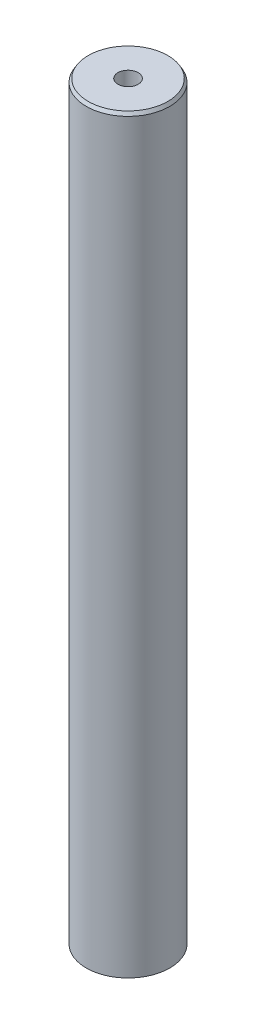
ISO-10303-21;
HEADER;
FILE_DESCRIPTION(('STEP AP214'),'2;1');
FILE_NAME('part.step','',(''),(''),'','','');
FILE_SCHEMA(('AUTOMOTIVE_DESIGN { 1 0 10303 214 1 1 1 1 }'));
ENDSEC;
DATA;
#1=APPLICATION_CONTEXT('core data for automotive mechanical design processes');
#2=APPLICATION_PROTOCOL_DEFINITION('international standard','automotive_design',2000,#1);
#3=PRODUCT_CONTEXT('',#1,'mechanical');
#4=PRODUCT('Part','Part','',(#3));
#5=PRODUCT_RELATED_PRODUCT_CATEGORY('part','',(#4));
#6=PRODUCT_DEFINITION_FORMATION('','',#4);
#7=PRODUCT_DEFINITION_CONTEXT('part definition',#1,'design');
#8=PRODUCT_DEFINITION('design','',#6,#7);
#9=PRODUCT_DEFINITION_SHAPE('','',#8);
#10=(LENGTH_UNIT() NAMED_UNIT(*) SI_UNIT(.MILLI.,.METRE.));
#11=(NAMED_UNIT(*) PLANE_ANGLE_UNIT() SI_UNIT($,.RADIAN.));
#12=(NAMED_UNIT(*) SI_UNIT($,.STERADIAN.) SOLID_ANGLE_UNIT());
#13=UNCERTAINTY_MEASURE_WITH_UNIT(LENGTH_MEASURE(1.E-05),#10,'distance_accuracy_value','');
#14=(GEOMETRIC_REPRESENTATION_CONTEXT(3) GLOBAL_UNCERTAINTY_ASSIGNED_CONTEXT((#13)) GLOBAL_UNIT_ASSIGNED_CONTEXT((#10,
#11,#12)) REPRESENTATION_CONTEXT('',''));
#15=CARTESIAN_POINT('',(0.,0.,0.));
#16=DIRECTION('',(0.,0.,1.));
#17=DIRECTION('',(1.,0.,0.));
#18=AXIS2_PLACEMENT_3D('',#15,#16,#17);
#19=CARTESIAN_POINT('',(0.,90.0144444900333,0.));
#20=DIRECTION('',(0.,-1.,0.));
#21=DIRECTION('',(0.,0.,-1.));
#22=AXIS2_PLACEMENT_3D('',#19,#20,#21);
#23=CYLINDRICAL_SURFACE('',#22,5.);
#24=CARTESIAN_POINT('',(0.,89.6137177139328,0.));
#25=DIRECTION('',(0.,1.,0.));
#26=DIRECTION('',(0.,0.,1.));
#27=AXIS2_PLACEMENT_3D('',#24,#25,#26);
#28=CIRCLE('',#27,5.);
#29=CARTESIAN_POINT('',(0.,89.6137177139328,-5.));
#30=VERTEX_POINT('',#29);
#31=EDGE_CURVE('E50',#30,#30,#28,.F.);
#32=ORIENTED_EDGE('',*,*,#31,.T.);
#33=EDGE_LOOP('',(#32));
#34=FACE_BOUND('',#33,.T.);
#35=CARTESIAN_POINT('',(0.,0.231359712053125,0.));
#36=DIRECTION('',(0.,1.,0.));
#37=DIRECTION('',(0.,0.,1.));
#38=AXIS2_PLACEMENT_3D('',#35,#36,#37);
#39=CIRCLE('',#38,5.);
#40=CARTESIAN_POINT('',(0.,0.231359712053125,5.));
#41=VERTEX_POINT('',#40);
#42=EDGE_CURVE('E51',#41,#41,#39,.T.);
#43=ORIENTED_EDGE('',*,*,#42,.T.);
#44=EDGE_LOOP('',(#43));
#45=FACE_BOUND('',#44,.T.);
#46=ADVANCED_FACE('F39',(#34,#45),#23,.T.);
#47=CARTESIAN_POINT('',(0.,90.0144444900333,0.));
#48=DIRECTION('',(0.,1.,0.));
#49=DIRECTION('',(0.,0.,1.));
#50=AXIS2_PLACEMENT_3D('',#47,#48,#49);
#51=PLANE('',#50);
#52=CARTESIAN_POINT('',(0.,90.0144444900333,0.));
#53=DIRECTION('',(0.,1.,0.));
#54=DIRECTION('',(0.,0.,1.));
#55=AXIS2_PLACEMENT_3D('',#52,#53,#54);
#56=CIRCLE('',#55,4.76864028794688);
#57=CARTESIAN_POINT('',(0.,90.0144444900333,-4.76864028794688));
#58=VERTEX_POINT('',#57);
#59=EDGE_CURVE('E54',#58,#58,#56,.T.);
#60=ORIENTED_EDGE('',*,*,#59,.T.);
#61=EDGE_LOOP('',(#60));
#62=FACE_BOUND('',#61,.T.);
#63=CARTESIAN_POINT('',(0.,90.0144444900333,0.));
#64=DIRECTION('',(0.,1.,0.));
#65=DIRECTION('',(0.,0.,1.));
#66=AXIS2_PLACEMENT_3D('',#63,#64,#65);
#67=CIRCLE('',#66,1.21272724082302);
#68=CARTESIAN_POINT('',(0.,90.0144444900333,1.21272724082302));
#69=VERTEX_POINT('',#68);
#70=EDGE_CURVE('E58',#69,#69,#67,.T.);
#71=ORIENTED_EDGE('',*,*,#70,.F.);
#72=EDGE_LOOP('',(#71));
#73=FACE_BOUND('',#72,.T.);
#74=ADVANCED_FACE('F69',(#62,#73),#51,.T.);
#75=CARTESIAN_POINT('',(0.,0.,0.));
#76=DIRECTION('',(0.,1.,0.));
#77=DIRECTION('',(0.,0.,1.));
#78=AXIS2_PLACEMENT_3D('',#75,#76,#77);
#79=PLANE('',#78);
#80=CARTESIAN_POINT('',(0.,0.,0.));
#81=DIRECTION('',(0.,1.,0.));
#82=DIRECTION('',(0.,0.,1.));
#83=AXIS2_PLACEMENT_3D('',#80,#81,#82);
#84=CIRCLE('',#83,4.59927322389948);
#85=CARTESIAN_POINT('',(0.,0.,4.59927322389948));
#86=VERTEX_POINT('',#85);
#87=EDGE_CURVE('E10',#86,#86,#84,.F.);
#88=ORIENTED_EDGE('',*,*,#87,.T.);
#89=EDGE_LOOP('',(#88));
#90=FACE_BOUND('',#89,.T.);
#91=CARTESIAN_POINT('',(0.,0.,0.));
#92=DIRECTION('',(0.,1.,0.));
#93=DIRECTION('',(0.,0.,1.));
#94=AXIS2_PLACEMENT_3D('',#91,#92,#93);
#95=CIRCLE('',#94,1.21272724082302);
#96=CARTESIAN_POINT('',(0.,0.,1.21272724082302));
#97=VERTEX_POINT('',#96);
#98=EDGE_CURVE('E63',#97,#97,#95,.T.);
#99=ORIENTED_EDGE('',*,*,#98,.T.);
#100=EDGE_LOOP('',(#99));
#101=FACE_BOUND('',#100,.T.);
#102=ADVANCED_FACE('F75',(#90,#101),#79,.F.);
#103=CARTESIAN_POINT('',(0.,90.0144444900333,0.));
#104=DIRECTION('',(0.,-1.,0.));
#105=DIRECTION('',(0.,0.,-1.));
#106=AXIS2_PLACEMENT_3D('',#103,#104,#105);
#107=CYLINDRICAL_SURFACE('',#106,1.21272724082302);
#108=ORIENTED_EDGE('',*,*,#70,.T.);
#109=EDGE_LOOP('',(#108));
#110=FACE_BOUND('',#109,.T.);
#111=ORIENTED_EDGE('',*,*,#98,.F.);
#112=EDGE_LOOP('',(#111));
#113=FACE_BOUND('',#112,.T.);
#114=ADVANCED_FACE('F70',(#110,#113),#107,.F.);
#115=CARTESIAN_POINT('',(0.,90.0144444900333,0.));
#116=DIRECTION('',(0.,-1.,0.));
#117=DIRECTION('',(0.,0.,-1.));
#118=AXIS2_PLACEMENT_3D('',#115,#116,#117);
#119=CONICAL_SURFACE('',#118,4.76864028794688,0.523598775598288);
#120=CARTESIAN_POINT('',(0.,89.6137177139328,-5.));
#121=CARTESIAN_POINT('',(0.,89.6178919511839,-4.99759000299945));
#122=CARTESIAN_POINT('',(0.,89.6220661884349,-4.9951800059989));
#123=CARTESIAN_POINT('',(0.,89.630414662937,-4.99036001199779));
#124=CARTESIAN_POINT('',(0.,89.634588900188,-4.98795001499724));
#125=CARTESIAN_POINT('',(0.,89.6429373746901,-4.98313002099613));
#126=CARTESIAN_POINT('',(0.,89.6471116119412,-4.98072002399558));
#127=CARTESIAN_POINT('',(0.,89.6554600864433,-4.97590002999447));
#128=CARTESIAN_POINT('',(0.,89.6596343236943,-4.97349003299392));
#129=CARTESIAN_POINT('',(0.,89.6679827981964,-4.96867003899281));
#130=CARTESIAN_POINT('',(0.,89.6721570354475,-4.96626004199226));
#131=CARTESIAN_POINT('',(0.,89.6805055099496,-4.96144004799115));
#132=CARTESIAN_POINT('',(0.,89.6846797472006,-4.9590300509906));
#133=CARTESIAN_POINT('',(0.,89.6930282217027,-4.95421005698949));
#134=CARTESIAN_POINT('',(0.,89.6972024589538,-4.95180005998894));
#135=CARTESIAN_POINT('',(0.,89.7055509334559,-4.94698006598783));
#136=CARTESIAN_POINT('',(0.,89.7097251707069,-4.94457006898728));
#137=CARTESIAN_POINT('',(0.,89.718073645209,-4.93975007498617));
#138=CARTESIAN_POINT('',(0.,89.72224788246,-4.93734007798562));
#139=CARTESIAN_POINT('',(0.,89.7305963569621,-4.93252008398451));
#140=CARTESIAN_POINT('',(0.,89.7347705942132,-4.93011008698396));
#141=CARTESIAN_POINT('',(0.,89.7431190687153,-4.92529009298285));
#142=CARTESIAN_POINT('',(0.,89.7472933059663,-4.9228800959823));
#143=CARTESIAN_POINT('',(0.,89.7556417804684,-4.91806010198119));
#144=CARTESIAN_POINT('',(0.,89.7598160177195,-4.91565010498064));
#145=CARTESIAN_POINT('',(0.,89.7681644922216,-4.91083011097953));
#146=CARTESIAN_POINT('',(0.,89.7723387294726,-4.90842011397898));
#147=CARTESIAN_POINT('',(0.,89.7806872039747,-4.90360011997787));
#148=CARTESIAN_POINT('',(0.,89.7848614412257,-4.90119012297732));
#149=CARTESIAN_POINT('',(0.,89.7932099157278,-4.89637012897621));
#150=CARTESIAN_POINT('',(0.,89.7973841529789,-4.89396013197566));
#151=CARTESIAN_POINT('',(0.,89.805732627481,-4.88914013797455));
#152=CARTESIAN_POINT('',(0.,89.809906864732,-4.886730140974));
#153=CARTESIAN_POINT('',(0.,89.8182553392341,-4.88191014697289));
#154=CARTESIAN_POINT('',(0.,89.8224295764852,-4.87950014997234));
#155=CARTESIAN_POINT('',(0.,89.8307780509873,-4.87468015597123));
#156=CARTESIAN_POINT('',(0.,89.8349522882383,-4.87227015897068));
#157=CARTESIAN_POINT('',(0.,89.8433007627404,-4.86745016496957));
#158=CARTESIAN_POINT('',(0.,89.8474749999915,-4.86504016796902));
#159=CARTESIAN_POINT('',(0.,89.8558234744936,-4.86022017396791));
#160=CARTESIAN_POINT('',(0.,89.8599977117446,-4.85781017696736));
#161=CARTESIAN_POINT('',(0.,89.8683461862467,-4.85299018296625));
#162=CARTESIAN_POINT('',(0.,89.8725204234977,-4.8505801859657));
#163=CARTESIAN_POINT('',(0.,89.8808688979998,-4.84576019196459));
#164=CARTESIAN_POINT('',(0.,89.8850431352509,-4.84335019496404));
#165=CARTESIAN_POINT('',(0.,89.893391609753,-4.83853020096293));
#166=CARTESIAN_POINT('',(0.,89.897565847004,-4.83612020396238));
#167=CARTESIAN_POINT('',(0.,89.9059143215061,-4.83130020996127));
#168=CARTESIAN_POINT('',(0.,89.9100885587572,-4.82889021296072));
#169=CARTESIAN_POINT('',(0.,89.9184370332593,-4.82407021895961));
#170=CARTESIAN_POINT('',(0.,89.9226112705103,-4.82166022195906));
#171=CARTESIAN_POINT('',(0.,89.9309597450124,-4.81684022795795));
#172=CARTESIAN_POINT('',(0.,89.9351339822634,-4.8144302309574));
#173=CARTESIAN_POINT('',(0.,89.9434824567655,-4.80961023695629));
#174=CARTESIAN_POINT('',(0.,89.9476566940166,-4.80720023995574));
#175=CARTESIAN_POINT('',(0.,89.9560051685187,-4.80238024595463));
#176=CARTESIAN_POINT('',(0.,89.9601794057697,-4.79997024895408));
#177=CARTESIAN_POINT('',(0.,89.9685278802718,-4.79515025495297));
#178=CARTESIAN_POINT('',(0.,89.9727021175229,-4.79274025795242));
#179=CARTESIAN_POINT('',(0.,89.981050592025,-4.78792026395131));
#180=CARTESIAN_POINT('',(0.,89.985224829276,-4.78551026695076));
#181=CARTESIAN_POINT('',(0.,89.9935733037781,-4.78069027294965));
#182=CARTESIAN_POINT('',(0.,89.9977475410292,-4.7782802759491));
#183=CARTESIAN_POINT('',(0.,90.0060960155313,-4.77346028194799));
#184=CARTESIAN_POINT('',(0.,90.0102702527823,-4.77105028494744));
#185=CARTESIAN_POINT('',(0.,90.0144444900333,-4.76864028794688));
#186=B_SPLINE_CURVE_WITH_KNOTS('',3,(#120,#121,#122,#123,#124,#125,#126,#127,#128,#129,#130,
#131,#132,#133,#134,#135,#136,#137,#138,#139,#140,#141,#142,#143,#144,#145,#146,#147,#148,#149,
#150,#151,#152,#153,#154,#155,#156,#157,#158,#159,#160,#161,#162,#163,#164,#165,#166,#167,#168,
#169,#170,#171,#172,#173,#174,#175,#176,#177,#178,#179,#180,#181,#182,#183,#184,#185),
.UNSPECIFIED.,.F.,.F.,(4,2,2,2,2,2,2,2,2,2,2,2,2,2,2,2,2,2,2,2,2,2,2,2,2,2,2,2,2,2,2,2,4),(0.,
0.0144599820033103,0.0289199640066325,0.0433799460099548,0.0578399280132771,0.0722999100165994,
0.0867598920199212,0.101219874023231,0.115679856026554,0.130139838029876,0.144599820033198,
0.159059802036521,0.173519784039842,0.187979766043153,0.202439748046475,0.216899730049797,
0.23135971205312,0.245819694056442,0.260279676059764,0.274739658063086,0.289199640066396,
0.303659622069718,0.318119604073041,0.332579586076363,0.347039568079685,0.361499550083007,
0.375959532086317,0.39041951408964,0.404879496092962,0.419339478096284,0.433799460099606,
0.448259442102929,0.462719424106251),.UNSPECIFIED.);
#187=EDGE_CURVE('BSEAM81',#30,#58,#186,.T.);
#188=ORIENTED_EDGE('',*,*,#31,.F.);
#189=ORIENTED_EDGE('',*,*,#59,.F.);
#190=ORIENTED_EDGE('',*,*,#187,.T.);
#191=ORIENTED_EDGE('',*,*,#187,.F.);
#192=EDGE_LOOP('',(#188,#190,#189,#191));
#193=FACE_BOUND('',#192,.T.);
#194=ADVANCED_FACE('F81',(#193),#119,.T.);
#195=CARTESIAN_POINT('',(0.,0.231359712053125,0.));
#196=DIRECTION('',(0.,1.,0.));
#197=DIRECTION('',(0.,0.,1.));
#198=AXIS2_PLACEMENT_3D('',#195,#196,#197);
#199=CONICAL_SURFACE('',#198,5.,1.0471975511966);
#200=ORIENTED_EDGE('',*,*,#87,.F.);
#201=EDGE_LOOP('',(#200));
#202=FACE_BOUND('',#201,.T.);
#203=ORIENTED_EDGE('',*,*,#42,.F.);
#204=EDGE_LOOP('',(#203));
#205=FACE_BOUND('',#204,.T.);
#206=ADVANCED_FACE('F45',(#202,#205),#199,.T.);
#207=CLOSED_SHELL('',(#46,#74,#102,#114,#194,#206));
#208=MANIFOLD_SOLID_BREP('B2',#207);
#209=ADVANCED_BREP_SHAPE_REPRESENTATION('',(#18,#208),#14);
#210=SHAPE_DEFINITION_REPRESENTATION(#9,#209);
ENDSEC;
END-ISO-10303-21;
